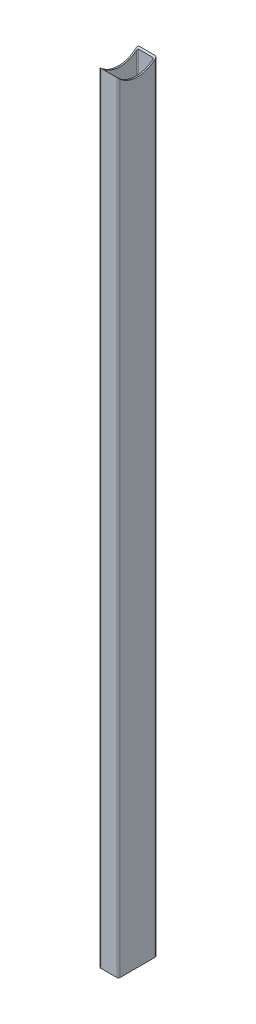
ISO-10303-21;
HEADER;
FILE_DESCRIPTION(('STEP AP214'),'2;1');
FILE_NAME('part.step','',(''),(''),'','','');
FILE_SCHEMA(('AUTOMOTIVE_DESIGN { 1 0 10303 214 1 1 1 1 }'));
ENDSEC;
DATA;
#1=APPLICATION_CONTEXT('core data for automotive mechanical design processes');
#2=APPLICATION_PROTOCOL_DEFINITION('international standard','automotive_design',2000,#1);
#3=PRODUCT_CONTEXT('',#1,'mechanical');
#4=PRODUCT('Part','Part','',(#3));
#5=PRODUCT_RELATED_PRODUCT_CATEGORY('part','',(#4));
#6=PRODUCT_DEFINITION_FORMATION('','',#4);
#7=PRODUCT_DEFINITION_CONTEXT('part definition',#1,'design');
#8=PRODUCT_DEFINITION('design','',#6,#7);
#9=PRODUCT_DEFINITION_SHAPE('','',#8);
#10=(LENGTH_UNIT() NAMED_UNIT(*) SI_UNIT(.MILLI.,.METRE.));
#11=(NAMED_UNIT(*) PLANE_ANGLE_UNIT() SI_UNIT($,.RADIAN.));
#12=(NAMED_UNIT(*) SI_UNIT($,.STERADIAN.) SOLID_ANGLE_UNIT());
#13=UNCERTAINTY_MEASURE_WITH_UNIT(LENGTH_MEASURE(1.E-05),#10,'distance_accuracy_value','');
#14=(GEOMETRIC_REPRESENTATION_CONTEXT(3) GLOBAL_UNCERTAINTY_ASSIGNED_CONTEXT((#13)) GLOBAL_UNIT_ASSIGNED_CONTEXT((#10,
#11,#12)) REPRESENTATION_CONTEXT('',''));
#15=CARTESIAN_POINT('',(0.,0.,0.));
#16=DIRECTION('',(0.,0.,1.));
#17=DIRECTION('',(1.,0.,0.));
#18=AXIS2_PLACEMENT_3D('',#15,#16,#17);
#19=CARTESIAN_POINT('',(1.499999999951,862.501,18.5));
#20=DIRECTION('',(0.,-1.,0.));
#21=DIRECTION('',(0.,0.,-1.));
#22=AXIS2_PLACEMENT_3D('',#19,#20,#21);
#23=CYLINDRICAL_SURFACE('',#22,1.5);
#24=CARTESIAN_POINT('',(-4.90081066006898E-11,814.653010050624,18.5));
#25=CARTESIAN_POINT('',(7.30435504471994E-06,814.695462627753,18.546691985452));
#26=CARTESIAN_POINT('',(0.00218000827948997,814.738060798896,18.5932187807497));
#27=CARTESIAN_POINT('',(0.0108205652073681,814.823380410035,18.6857694418457));
#28=CARTESIAN_POINT('',(0.0172889873663088,814.866101865619,18.7317932401786));
#29=CARTESIAN_POINT('',(0.0431845103338715,814.994683944242,18.8693695086153));
#30=CARTESIAN_POINT('',(0.0691012309733102,815.080459256448,18.9598738396438));
#31=CARTESIAN_POINT('',(0.13884570583917,815.25113121617,19.1375970737993));
#32=CARTESIAN_POINT('',(0.182950957465307,815.335992363237,19.2247411235328));
#33=CARTESIAN_POINT('',(0.289864777848783,815.500765465674,19.3918416231965));
#34=CARTESIAN_POINT('',(0.352629834144788,815.580688418312,19.4718142374703));
#35=CARTESIAN_POINT('',(0.475885185609801,815.708570285806,19.5983728963342));
#36=CARTESIAN_POINT('',(0.531192829918792,815.75882575246,19.6476862012693));
#37=CARTESIAN_POINT('',(0.65192017080001,815.853087395314,19.7395552345383));
#38=CARTESIAN_POINT('',(0.717327538064841,815.8971010672,19.7821190755995));
#39=CARTESIAN_POINT('',(0.842406169397348,815.967261578513,19.8496018639839));
#40=CARTESIAN_POINT('',(0.900080290298504,815.995202146607,19.8763375751384));
#41=CARTESIAN_POINT('',(1.02085119046355,816.043997130117,19.9228786035671));
#42=CARTESIAN_POINT('',(1.08393227330552,816.064871241041,19.9427031880942));
#43=CARTESIAN_POINT('',(1.20521673179596,816.095648697567,19.9718775632913));
#44=CARTESIAN_POINT('',(1.26286636010349,816.106678912796,19.9823053545535));
#45=CARTESIAN_POINT('',(1.35081783343951,816.117849919002,19.9928595387236));
#46=CARTESIAN_POINT('',(1.3805037816435,816.12067825902,19.9955300250173));
#47=CARTESIAN_POINT('',(1.44012152436002,816.124462993875,19.9991026272695));
#48=CARTESIAN_POINT('',(1.47005348029876,816.125418041235,20.0000034703092));
#49=CARTESIAN_POINT('',(1.49999999995103,816.125413911822,20.));
#50=B_SPLINE_CURVE_WITH_KNOTS('',3,(#24,#25,#26,#27,#28,#29,#30,#31,#32,#33,#34,#35,#36,#37,#38,
#39,#40,#41,#42,#43,#44,#45,#46,#47,#48,#49),.UNSPECIFIED.,.F.,.F.,(4,2,2,2,2,2,2,2,2,2,2,2,4),
(0.,0.189233362172743,0.37849180157302,0.75923270951333,1.14601099830748,1.53189434719916,
1.79967967808632,2.06714065553922,2.27468866915641,2.48165335182276,2.65963914067694,
2.74935789937733,2.83914116992311),.UNSPECIFIED.);
#51=CARTESIAN_POINT('',(-4.9069255603218E-11,814.653010050624,18.5));
#52=VERTEX_POINT('',#51);
#53=CARTESIAN_POINT('',(1.49999999995102,816.125413911823,20.));
#54=VERTEX_POINT('',#53);
#55=EDGE_CURVE('E171',#52,#54,#50,.T.);
#56=ORIENTED_EDGE('',*,*,#55,.F.);
#57=DIRECTION('',(0.,-1.,0.));
#58=VECTOR('',#57,1.);
#59=CARTESIAN_POINT('',(-4.90033361111308E-11,862.501,18.5));
#60=LINE('',#59,#58);
#61=CARTESIAN_POINT('',(-4.90033361111308E-11,0.,18.5));
#62=VERTEX_POINT('',#61);
#63=EDGE_CURVE('E157',#52,#62,#60,.T.);
#64=ORIENTED_EDGE('',*,*,#63,.T.);
#65=CARTESIAN_POINT('',(1.499999999951,0.,18.5));
#66=DIRECTION('',(0.,1.,0.));
#67=DIRECTION('',(0.,0.,-1.));
#68=AXIS2_PLACEMENT_3D('',#65,#66,#67);
#69=CIRCLE('',#68,1.5);
#70=CARTESIAN_POINT('',(1.49999999995102,0.,20.));
#71=VERTEX_POINT('',#70);
#72=EDGE_CURVE('E167',#62,#71,#69,.T.);
#73=ORIENTED_EDGE('',*,*,#72,.T.);
#74=DIRECTION('',(0.,-1.,0.));
#75=VECTOR('',#74,1.);
#76=CARTESIAN_POINT('',(1.49999999995102,862.501,20.));
#77=LINE('',#76,#75);
#78=EDGE_CURVE('E172',#54,#71,#77,.T.);
#79=ORIENTED_EDGE('',*,*,#78,.F.);
#80=EDGE_LOOP('',(#56,#64,#73,#79));
#81=FACE_BOUND('',#80,.T.);
#82=ADVANCED_FACE('F34',(#81),#23,.T.);
#83=CARTESIAN_POINT('',(18.499999999951,862.501,20.));
#84=DIRECTION('',(0.,0.,-1.));
#85=DIRECTION('',(-1.,0.,0.));
#86=AXIS2_PLACEMENT_3D('',#83,#84,#85);
#87=PLANE('',#86);
#88=DIRECTION('',(1.,0.,0.));
#89=VECTOR('',#88,1.);
#90=CARTESIAN_POINT('',(1000.,816.125413911823,20.));
#91=LINE('',#90,#89);
#92=CARTESIAN_POINT('',(18.499999999951,816.125413911822,20.));
#93=VERTEX_POINT('',#92);
#94=EDGE_CURVE('E175',#54,#93,#91,.T.);
#95=ORIENTED_EDGE('',*,*,#94,.F.);
#96=ORIENTED_EDGE('',*,*,#78,.T.);
#97=DIRECTION('',(1.,0.,0.));
#98=VECTOR('',#97,1.);
#99=CARTESIAN_POINT('',(18.499999999951,0.,20.));
#100=LINE('',#99,#98);
#101=CARTESIAN_POINT('',(18.499999999951,0.,20.));
#102=VERTEX_POINT('',#101);
#103=EDGE_CURVE('E211',#71,#102,#100,.T.);
#104=ORIENTED_EDGE('',*,*,#103,.T.);
#105=DIRECTION('',(0.,-1.,0.));
#106=VECTOR('',#105,1.);
#107=CARTESIAN_POINT('',(18.499999999951,862.501,20.));
#108=LINE('',#107,#106);
#109=EDGE_CURVE('E212',#93,#102,#108,.T.);
#110=ORIENTED_EDGE('',*,*,#109,.F.);
#111=EDGE_LOOP('',(#95,#96,#104,#110));
#112=FACE_BOUND('',#111,.T.);
#113=ADVANCED_FACE('F304',(#112),#87,.F.);
#114=CARTESIAN_POINT('',(18.499999999951,862.501,18.5));
#115=DIRECTION('',(0.,-1.,0.));
#116=DIRECTION('',(0.,0.,-1.));
#117=AXIS2_PLACEMENT_3D('',#114,#115,#116);
#118=CYLINDRICAL_SURFACE('',#117,1.50000000000001);
#119=CARTESIAN_POINT('',(18.499999999951,816.125413911822,20.));
#120=CARTESIAN_POINT('',(18.5333113732731,816.125424087684,20.0000088116086));
#121=CARTESIAN_POINT('',(18.5666152079335,816.124238455771,19.9988906724533));
#122=CARTESIAN_POINT('',(18.6328835528713,816.11955401349,19.9944686876159));
#123=CARTESIAN_POINT('',(18.6658483497157,816.116057353734,19.9911668740292));
#124=CARTESIAN_POINT('',(18.7308684166158,816.106872669418,19.9824867495289));
#125=CARTESIAN_POINT('',(18.7629293402837,816.101205684626,19.9771283744821));
#126=CARTESIAN_POINT('',(18.8262192850358,816.087816574404,19.964453495491));
#127=CARTESIAN_POINT('',(18.8574481580004,816.080094085713,19.9571366454313));
#128=CARTESIAN_POINT('',(18.9493527110668,816.054139888762,19.9325099338898));
#129=CARTESIAN_POINT('',(19.0085368907333,816.033078245195,19.9124832938736));
#130=CARTESIAN_POINT('',(19.1218904187204,815.98480390376,19.8663895352073));
#131=CARTESIAN_POINT('',(19.1760463656176,815.957575397783,19.8403068882126));
#132=CARTESIAN_POINT('',(19.3022249274388,815.884885235681,19.7703295412264));
#133=CARTESIAN_POINT('',(19.3712088466082,815.836755424213,19.7237219263429));
#134=CARTESIAN_POINT('',(19.4976494455237,815.733685237651,19.6230564583275));
#135=CARTESIAN_POINT('',(19.5550825233357,815.678731281754,19.5689837241006));
#136=CARTESIAN_POINT('',(19.6788997970576,815.542379807497,19.4335635500316));
#137=CARTESIAN_POINT('',(19.7402693280586,815.458923656369,19.3497091047197));
#138=CARTESIAN_POINT('',(19.8434028116411,815.287422961515,19.1749673553413));
#139=CARTESIAN_POINT('',(19.8851388896993,815.199372090163,19.0840702643239));
#140=CARTESIAN_POINT('',(19.9449324985606,815.034480748939,18.9113754961407));
#141=CARTESIAN_POINT('',(19.9655743855466,814.957902130196,18.8302129095988));
#142=CARTESIAN_POINT('',(19.9862129565659,814.843177099591,18.7071009885416));
#143=CARTESIAN_POINT('',(19.9913716528525,814.805053823465,18.6659396699617));
#144=CARTESIAN_POINT('',(19.998262989844,814.728917439247,18.5832283507239));
#145=CARTESIAN_POINT('',(19.9999955374597,814.690904334177,18.5416783395359));
#146=CARTESIAN_POINT('',(19.999999999951,814.653010050624,18.5));
#147=B_SPLINE_CURVE_WITH_KNOTS('',3,(#119,#120,#121,#122,#123,#124,#125,#126,#127,#128,#129,
#130,#131,#132,#133,#134,#135,#136,#137,#138,#139,#140,#141,#142,#143,#144,#145,#146),
.UNSPECIFIED.,.F.,.F.,(4,2,2,2,2,2,2,2,2,2,2,2,2,4),(0.,0.0998820554474782,0.19967129266649,
0.298516676841998,0.39737954121553,0.594227700382906,0.791586288007646,1.07846843536314,
1.36593094554802,1.76364029717461,2.16191260366413,2.50144706730808,2.67037656865549,
2.83931065979073),.UNSPECIFIED.);
#148=CARTESIAN_POINT('',(19.9999999999511,814.653010050624,18.5));
#149=VERTEX_POINT('',#148);
#150=EDGE_CURVE('E293',#93,#149,#147,.T.);
#151=ORIENTED_EDGE('',*,*,#150,.F.);
#152=ORIENTED_EDGE('',*,*,#109,.T.);
#153=CARTESIAN_POINT('',(18.499999999951,0.,18.5));
#154=DIRECTION('',(0.,1.,0.));
#155=DIRECTION('',(0.,0.,-1.));
#156=AXIS2_PLACEMENT_3D('',#153,#154,#155);
#157=CIRCLE('',#156,1.50000000000001);
#158=CARTESIAN_POINT('',(19.999999999951,0.,18.5));
#159=VERTEX_POINT('',#158);
#160=EDGE_CURVE('E214',#102,#159,#157,.T.);
#161=ORIENTED_EDGE('',*,*,#160,.T.);
#162=DIRECTION('',(0.,-1.,0.));
#163=VECTOR('',#162,1.);
#164=CARTESIAN_POINT('',(19.999999999951,862.501,18.5));
#165=LINE('',#164,#163);
#166=EDGE_CURVE('E215',#149,#159,#165,.T.);
#167=ORIENTED_EDGE('',*,*,#166,.F.);
#168=EDGE_LOOP('',(#151,#152,#161,#167));
#169=FACE_BOUND('',#168,.T.);
#170=ADVANCED_FACE('F300',(#169),#118,.T.);
#171=CARTESIAN_POINT('',(19.999999999951,862.501,18.5));
#172=DIRECTION('',(-1.,0.,0.));
#173=DIRECTION('',(0.,0.,1.));
#174=AXIS2_PLACEMENT_3D('',#171,#172,#173);
#175=PLANE('',#174);
#176=CARTESIAN_POINT('',(19.9999999999511,835.,6.65578703262783E-13));
#177=DIRECTION('',(-1.,0.,0.));
#178=DIRECTION('',(0.,0.,1.));
#179=AXIS2_PLACEMENT_3D('',#176,#177,#178);
#180=CIRCLE('',#179,27.5);
#181=CARTESIAN_POINT('',(19.999999999951,814.653010050625,-18.5));
#182=VERTEX_POINT('',#181);
#183=EDGE_CURVE('E185',#149,#182,#180,.F.);
#184=ORIENTED_EDGE('',*,*,#183,.F.);
#185=ORIENTED_EDGE('',*,*,#166,.T.);
#186=DIRECTION('',(0.,0.,-1.));
#187=VECTOR('',#186,1.);
#188=CARTESIAN_POINT('',(19.999999999951,0.,18.5));
#189=LINE('',#188,#187);
#190=CARTESIAN_POINT('',(19.999999999951,0.,-18.5));
#191=VERTEX_POINT('',#190);
#192=EDGE_CURVE('E217',#159,#191,#189,.T.);
#193=ORIENTED_EDGE('',*,*,#192,.T.);
#194=DIRECTION('',(0.,-1.,0.));
#195=VECTOR('',#194,1.);
#196=CARTESIAN_POINT('',(19.999999999951,862.501,-18.5));
#197=LINE('',#196,#195);
#198=EDGE_CURVE('E218',#182,#191,#197,.T.);
#199=ORIENTED_EDGE('',*,*,#198,.F.);
#200=EDGE_LOOP('',(#184,#185,#193,#199));
#201=FACE_BOUND('',#200,.T.);
#202=ADVANCED_FACE('F283',(#201),#175,.F.);
#203=CARTESIAN_POINT('',(18.499999999951,862.501,-18.5));
#204=DIRECTION('',(0.,-1.,0.));
#205=DIRECTION('',(0.,0.,-1.));
#206=AXIS2_PLACEMENT_3D('',#203,#204,#205);
#207=CYLINDRICAL_SURFACE('',#206,1.5);
#208=CARTESIAN_POINT('',(19.999999999951,814.653010050625,-18.5));
#209=CARTESIAN_POINT('',(19.9999926955469,814.695462627754,-18.5466919854521));
#210=CARTESIAN_POINT('',(19.9978199916225,814.738060798897,-18.5932187807498));
#211=CARTESIAN_POINT('',(19.9891794346946,814.823380410037,-18.6857694418457));
#212=CARTESIAN_POINT('',(19.9827110125357,814.86610186562,-18.7317932401786));
#213=CARTESIAN_POINT('',(19.9568154895681,814.994683944243,-18.8693695086154));
#214=CARTESIAN_POINT('',(19.9308987689287,815.080459256449,-18.9598738396438));
#215=CARTESIAN_POINT('',(19.8611542940628,815.251131216171,-19.1375970737994));
#216=CARTESIAN_POINT('',(19.8170490424367,815.335992363238,-19.2247411235328));
#217=CARTESIAN_POINT('',(19.7101352220532,815.500765465676,-19.3918416231966));
#218=CARTESIAN_POINT('',(19.6473701657572,815.580688418313,-19.4718142374704));
#219=CARTESIAN_POINT('',(19.5241148142921,815.708570285808,-19.5983728963342));
#220=CARTESIAN_POINT('',(19.4688071699831,815.758825752462,-19.6476862012694));
#221=CARTESIAN_POINT('',(19.3480798291019,815.853087395315,-19.7395552345383));
#222=CARTESIAN_POINT('',(19.2826724618371,815.897101067202,-19.7821190755995));
#223=CARTESIAN_POINT('',(19.1575938305047,815.967261578514,-19.8496018639839));
#224=CARTESIAN_POINT('',(19.0999197096035,815.995202146608,-19.8763375751384));
#225=CARTESIAN_POINT('',(18.9791488094385,816.043997130118,-19.9228786035671));
#226=CARTESIAN_POINT('',(18.9160677265965,816.064871241043,-19.9427031880942));
#227=CARTESIAN_POINT('',(18.7947832681061,816.095648697568,-19.9718775632913));
#228=CARTESIAN_POINT('',(18.7371336397985,816.106678912797,-19.9823053545535));
#229=CARTESIAN_POINT('',(18.6491821664625,816.117849919003,-19.9928595387236));
#230=CARTESIAN_POINT('',(18.6194962182585,816.120678259022,-19.9955300250173));
#231=CARTESIAN_POINT('',(18.559878475542,816.124462993876,-19.9991026272695));
#232=CARTESIAN_POINT('',(18.5299465196033,816.125418041236,-20.0000034703092));
#233=CARTESIAN_POINT('',(18.499999999951,816.125413911824,-20.));
#234=B_SPLINE_CURVE_WITH_KNOTS('',3,(#208,#209,#210,#211,#212,#213,#214,#215,#216,#217,#218,
#219,#220,#221,#222,#223,#224,#225,#226,#227,#228,#229,#230,#231,#232,#233),.UNSPECIFIED.,.F.,
.F.,(4,2,2,2,2,2,2,2,2,2,2,2,4),(0.,0.18923336217275,0.378491801573142,0.759232709513421,
1.14601099830756,1.53189434719939,1.79967967808651,2.06714065553934,2.27468866915651,
2.48165335182286,2.65963914067704,2.74935789937744,2.83914116992321),.UNSPECIFIED.);
#235=CARTESIAN_POINT('',(18.499999999951,816.125413911824,-20.));
#236=VERTEX_POINT('',#235);
#237=EDGE_CURVE('E286',#182,#236,#234,.T.);
#238=ORIENTED_EDGE('',*,*,#237,.F.);
#239=ORIENTED_EDGE('',*,*,#198,.T.);
#240=CARTESIAN_POINT('',(18.499999999951,0.,-18.5));
#241=DIRECTION('',(0.,1.,0.));
#242=DIRECTION('',(0.,0.,1.));
#243=AXIS2_PLACEMENT_3D('',#240,#241,#242);
#244=CIRCLE('',#243,1.5);
#245=CARTESIAN_POINT('',(18.499999999951,0.,-20.));
#246=VERTEX_POINT('',#245);
#247=EDGE_CURVE('E220',#191,#246,#244,.T.);
#248=ORIENTED_EDGE('',*,*,#247,.T.);
#249=DIRECTION('',(0.,-1.,0.));
#250=VECTOR('',#249,1.);
#251=CARTESIAN_POINT('',(18.499999999951,862.501,-20.));
#252=LINE('',#251,#250);
#253=EDGE_CURVE('E221',#236,#246,#252,.T.);
#254=ORIENTED_EDGE('',*,*,#253,.F.);
#255=EDGE_LOOP('',(#238,#239,#248,#254));
#256=FACE_BOUND('',#255,.T.);
#257=ADVANCED_FACE('F279',(#256),#207,.T.);
#258=CARTESIAN_POINT('',(18.499999999951,862.501,-20.));
#259=DIRECTION('',(0.,0.,1.));
#260=DIRECTION('',(1.,0.,0.));
#261=AXIS2_PLACEMENT_3D('',#258,#259,#260);
#262=PLANE('',#261);
#263=DIRECTION('',(1.,0.,0.));
#264=VECTOR('',#263,1.);
#265=CARTESIAN_POINT('',(1000.,816.125413911824,-20.));
#266=LINE('',#265,#264);
#267=CARTESIAN_POINT('',(1.49999999995102,816.125413911824,-20.));
#268=VERTEX_POINT('',#267);
#269=EDGE_CURVE('E45',#236,#268,#266,.F.);
#270=ORIENTED_EDGE('',*,*,#269,.F.);
#271=ORIENTED_EDGE('',*,*,#253,.T.);
#272=DIRECTION('',(-1.,0.,0.));
#273=VECTOR('',#272,1.);
#274=CARTESIAN_POINT('',(18.499999999951,0.,-20.));
#275=LINE('',#274,#273);
#276=CARTESIAN_POINT('',(1.49999999995102,0.,-20.));
#277=VERTEX_POINT('',#276);
#278=EDGE_CURVE('E222',#246,#277,#275,.T.);
#279=ORIENTED_EDGE('',*,*,#278,.T.);
#280=DIRECTION('',(0.,-1.,0.));
#281=VECTOR('',#280,1.);
#282=CARTESIAN_POINT('',(1.49999999995102,862.501,-20.));
#283=LINE('',#282,#281);
#284=EDGE_CURVE('E223',#268,#277,#283,.T.);
#285=ORIENTED_EDGE('',*,*,#284,.F.);
#286=EDGE_LOOP('',(#270,#271,#279,#285));
#287=FACE_BOUND('',#286,.T.);
#288=ADVANCED_FACE('F275',(#287),#262,.F.);
#289=CARTESIAN_POINT('',(1.49999999995099,862.501,-18.5));
#290=DIRECTION('',(0.,-1.,0.));
#291=DIRECTION('',(0.,0.,-1.));
#292=AXIS2_PLACEMENT_3D('',#289,#290,#291);
#293=CYLINDRICAL_SURFACE('',#292,1.5);
#294=CARTESIAN_POINT('',(1.49999999995102,816.125413911824,-20.));
#295=CARTESIAN_POINT('',(1.46668862662889,816.125424087685,-20.0000088116086));
#296=CARTESIAN_POINT('',(1.43338479196853,816.124238455772,-19.9988906724533));
#297=CARTESIAN_POINT('',(1.36711644703071,816.119554013492,-19.994468687616));
#298=CARTESIAN_POINT('',(1.33415165018626,816.116057353736,-19.9911668740292));
#299=CARTESIAN_POINT('',(1.26913158328619,816.106872669419,-19.9824867495289));
#300=CARTESIAN_POINT('',(1.23707065961828,816.101205684627,-19.9771283744821));
#301=CARTESIAN_POINT('',(1.17378071486622,816.087816574406,-19.964453495491));
#302=CARTESIAN_POINT('',(1.14255184190159,816.080094085714,-19.9571366454313));
#303=CARTESIAN_POINT('',(1.05064728883521,816.054139888763,-19.9325099338898));
#304=CARTESIAN_POINT('',(0.991463109168682,816.033078245196,-19.9124832938736));
#305=CARTESIAN_POINT('',(0.87810958118168,815.984803903761,-19.8663895352073));
#306=CARTESIAN_POINT('',(0.82395363428446,815.957575397785,-19.8403068882126));
#307=CARTESIAN_POINT('',(0.697775072463238,815.884885235682,-19.7703295412264));
#308=CARTESIAN_POINT('',(0.628791153293828,815.836755424214,-19.7237219263429));
#309=CARTESIAN_POINT('',(0.502350554378285,815.733685237652,-19.6230564583276));
#310=CARTESIAN_POINT('',(0.444917476566286,815.678731281755,-19.5689837241006));
#311=CARTESIAN_POINT('',(0.321100202844451,815.542379807498,-19.4335635500317));
#312=CARTESIAN_POINT('',(0.259730671843445,815.458923656371,-19.3497091047198));
#313=CARTESIAN_POINT('',(0.156597188260996,815.287422961516,-19.1749673553414));
#314=CARTESIAN_POINT('',(0.114861110202781,815.199372090165,-19.0840702643241));
#315=CARTESIAN_POINT('',(0.0550675013413811,815.034480748941,-18.9113754961408));
#316=CARTESIAN_POINT('',(0.034425614355364,814.957902130198,-18.8302129095988));
#317=CARTESIAN_POINT('',(0.0137870433360509,814.843177099593,-18.7071009885416));
#318=CARTESIAN_POINT('',(0.00862834704948749,814.805053823466,-18.6659396699618));
#319=CARTESIAN_POINT('',(0.00173701005803714,814.728917439248,-18.583228350724));
#320=CARTESIAN_POINT('',(4.46244234632895E-06,814.690904334179,-18.541678339536));
#321=CARTESIAN_POINT('',(-4.90084382694184E-11,814.653010050625,-18.5));
#322=B_SPLINE_CURVE_WITH_KNOTS('',3,(#294,#295,#296,#297,#298,#299,#300,#301,#302,#303,#304,
#305,#306,#307,#308,#309,#310,#311,#312,#313,#314,#315,#316,#317,#318,#319,#320,#321),
.UNSPECIFIED.,.F.,.F.,(4,2,2,2,2,2,2,2,2,2,2,2,2,4),(0.,0.0998820554474835,0.199671292666493,
0.298516676842009,0.397379541215487,0.594227700382861,0.791586288007568,1.0784684353631,
1.36593094554795,1.76364029717448,2.16191260366398,2.50144706730812,2.67037656865558,
2.83931065979085),.UNSPECIFIED.);
#323=CARTESIAN_POINT('',(-4.90744597736459E-11,814.653010050625,-18.5));
#324=VERTEX_POINT('',#323);
#325=EDGE_CURVE('E11',#268,#324,#322,.T.);
#326=ORIENTED_EDGE('',*,*,#325,.F.);
#327=ORIENTED_EDGE('',*,*,#284,.T.);
#328=CARTESIAN_POINT('',(1.49999999995099,0.,-18.5));
#329=DIRECTION('',(0.,1.,0.));
#330=DIRECTION('',(0.,0.,-1.));
#331=AXIS2_PLACEMENT_3D('',#328,#329,#330);
#332=CIRCLE('',#331,1.5);
#333=CARTESIAN_POINT('',(-4.90085402815588E-11,0.,-18.5));
#334=VERTEX_POINT('',#333);
#335=EDGE_CURVE('E224',#277,#334,#332,.T.);
#336=ORIENTED_EDGE('',*,*,#335,.T.);
#337=DIRECTION('',(0.,-1.,0.));
#338=VECTOR('',#337,1.);
#339=CARTESIAN_POINT('',(-4.90085402815588E-11,862.501,-18.5));
#340=LINE('',#339,#338);
#341=EDGE_CURVE('E39',#324,#334,#340,.T.);
#342=ORIENTED_EDGE('',*,*,#341,.F.);
#343=EDGE_LOOP('',(#326,#327,#336,#342));
#344=FACE_BOUND('',#343,.T.);
#345=ADVANCED_FACE('F270',(#344),#293,.T.);
#346=CARTESIAN_POINT('',(-4.90033361111308E-11,862.501,18.5));
#347=DIRECTION('',(1.,0.,0.));
#348=DIRECTION('',(0.,0.,-1.));
#349=AXIS2_PLACEMENT_3D('',#346,#347,#348);
#350=PLANE('',#349);
#351=CARTESIAN_POINT('',(-4.90718576884319E-11,835.,6.66133814775095E-13));
#352=DIRECTION('',(1.,0.,0.));
#353=DIRECTION('',(0.,0.,-1.));
#354=AXIS2_PLACEMENT_3D('',#351,#352,#353);
#355=CIRCLE('',#354,27.5);
#356=EDGE_CURVE('E161',#324,#52,#355,.F.);
#357=ORIENTED_EDGE('',*,*,#356,.F.);
#358=ORIENTED_EDGE('',*,*,#341,.T.);
#359=DIRECTION('',(0.,0.,1.));
#360=VECTOR('',#359,1.);
#361=CARTESIAN_POINT('',(-4.90033361111308E-11,0.,18.5));
#362=LINE('',#361,#360);
#363=EDGE_CURVE('E163',#334,#62,#362,.T.);
#364=ORIENTED_EDGE('',*,*,#363,.T.);
#365=ORIENTED_EDGE('',*,*,#63,.F.);
#366=EDGE_LOOP('',(#357,#358,#364,#365));
#367=FACE_BOUND('',#366,.T.);
#368=ADVANCED_FACE('F159',(#367),#350,.F.);
#369=CARTESIAN_POINT('',(2.49999999995099,862.501,-17.5));
#370=DIRECTION('',(0.,-1.,0.));
#371=DIRECTION('',(0.,0.,-1.));
#372=AXIS2_PLACEMENT_3D('',#369,#370,#371);
#373=CYLINDRICAL_SURFACE('',#372,0.999999999999994);
#374=DIRECTION('',(0.,-1.,0.));
#375=VECTOR('',#374,1.);
#376=CARTESIAN_POINT('',(2.49999999995099,862.501,-18.5));
#377=LINE('',#376,#375);
#378=CARTESIAN_POINT('',(2.49999999995099,814.653010050626,-18.5));
#379=VERTEX_POINT('',#378);
#380=CARTESIAN_POINT('',(2.49999999995099,0.,-18.5));
#381=VERTEX_POINT('',#380);
#382=EDGE_CURVE('E207',#379,#381,#377,.T.);
#383=ORIENTED_EDGE('',*,*,#382,.F.);
#384=CARTESIAN_POINT('',(2.49999999995099,814.653010050625,-18.5));
#385=CARTESIAN_POINT('',(2.4768758007585,814.653012903492,-18.5000028203874));
#386=CARTESIAN_POINT('',(2.45376543957132,814.652280128873,-18.4991972318456));
#387=CARTESIAN_POINT('',(2.40776137938364,814.649376694845,-18.4960033043079));
#388=CARTESIAN_POINT('',(2.38486753816628,814.64720705699,-18.4936160897866));
#389=CARTESIAN_POINT('',(2.31714059027825,814.638641336101,-18.4841864363175));
#390=CARTESIAN_POINT('',(2.27285302025477,814.630187137745,-18.4748746344818));
#391=CARTESIAN_POINT('',(2.18720801666056,814.608435415342,-18.4508631192869));
#392=CARTESIAN_POINT('',(2.14584362310439,814.595149892811,-18.436176756335));
#393=CARTESIAN_POINT('',(2.0665779903082,814.564524809467,-18.4022248060017));
#394=CARTESIAN_POINT('',(2.02868421706482,814.54717678172,-18.3829496534079));
#395=CARTESIAN_POINT('',(1.94342135576491,814.502164490542,-18.3327643627301));
#396=CARTESIAN_POINT('',(1.89778678201146,814.473065422087,-18.3001956239715));
#397=CARTESIAN_POINT('',(1.81417470855712,814.41054194512,-18.2298229485488));
#398=CARTESIAN_POINT('',(1.77621056636586,814.377110154813,-18.1920100693846));
#399=CARTESIAN_POINT('',(1.69739912389999,814.296633873829,-18.100424631936));
#400=CARTESIAN_POINT('',(1.65919535809688,814.248544590507,-18.0452988640444));
#401=CARTESIAN_POINT('',(1.59511161754661,814.149434234561,-17.9306908265584));
#402=CARTESIAN_POINT('',(1.56924711037069,814.098409571628,-17.8712031964045));
#403=CARTESIAN_POINT('',(1.53289199741373,814.003768269603,-17.7598603001842));
#404=CARTESIAN_POINT('',(1.52053844484862,813.960362167747,-17.7084207546165));
#405=CARTESIAN_POINT('',(1.50412568657601,813.873501265473,-17.6047060742996));
#406=CARTESIAN_POINT('',(1.50002615078288,813.830047744954,-17.5524362664432));
#407=CARTESIAN_POINT('',(1.499999999951,813.786796564404,-17.5000000000001));
#408=B_SPLINE_CURVE_WITH_KNOTS('',3,(#384,#385,#386,#387,#388,#389,#390,#391,#392,#393,#394,
#395,#396,#397,#398,#399,#400,#401,#402,#403,#404,#405,#406,#407),.UNSPECIFIED.,.F.,.F.,(4,2,2,
2,2,2,2,2,2,2,2,4),(0.,0.0693207055212529,0.138592179527208,0.275926774670232,0.412922520954456,
0.550206370971967,0.738672865075858,0.927464783810286,1.17375700665125,1.4203571570221,
1.62515244956237,1.82894463618197),.UNSPECIFIED.);
#409=CARTESIAN_POINT('',(1.49999999995098,813.786796564404,-17.5));
#410=VERTEX_POINT('',#409);
#411=EDGE_CURVE('E81',#379,#410,#408,.T.);
#412=ORIENTED_EDGE('',*,*,#411,.T.);
#413=DIRECTION('',(0.,-1.,0.));
#414=VECTOR('',#413,1.);
#415=CARTESIAN_POINT('',(1.49999999995099,862.501,-17.5));
#416=LINE('',#415,#414);
#417=CARTESIAN_POINT('',(1.49999999995099,0.,-17.5));
#418=VERTEX_POINT('',#417);
#419=EDGE_CURVE('E151',#410,#418,#416,.T.);
#420=ORIENTED_EDGE('',*,*,#419,.T.);
#421=CARTESIAN_POINT('',(2.49999999995099,0.,-17.5));
#422=DIRECTION('',(0.,1.,0.));
#423=DIRECTION('',(0.,0.,-1.));
#424=AXIS2_PLACEMENT_3D('',#421,#422,#423);
#425=CIRCLE('',#424,0.999999999999994);
#426=EDGE_CURVE('E246',#381,#418,#425,.T.);
#427=ORIENTED_EDGE('',*,*,#426,.F.);
#428=EDGE_LOOP('',(#383,#412,#420,#427));
#429=FACE_BOUND('',#428,.T.);
#430=ADVANCED_FACE('F331',(#429),#373,.F.);
#431=CARTESIAN_POINT('',(1.499999999951,862.501,17.5));
#432=DIRECTION('',(1.,0.,0.));
#433=DIRECTION('',(0.,0.,-1.));
#434=AXIS2_PLACEMENT_3D('',#431,#432,#433);
#435=PLANE('',#434);
#436=ORIENTED_EDGE('',*,*,#419,.F.);
#437=CARTESIAN_POINT('',(1.49999999995098,835.,6.66092181411672E-13));
#438=DIRECTION('',(1.,0.,0.));
#439=DIRECTION('',(0.,0.,-1.));
#440=AXIS2_PLACEMENT_3D('',#437,#438,#439);
#441=CIRCLE('',#440,27.5);
#442=CARTESIAN_POINT('',(1.49999999995099,813.786796564403,17.5));
#443=VERTEX_POINT('',#442);
#444=EDGE_CURVE('E54',#410,#443,#441,.F.);
#445=ORIENTED_EDGE('',*,*,#444,.T.);
#446=DIRECTION('',(0.,-1.,0.));
#447=VECTOR('',#446,1.);
#448=CARTESIAN_POINT('',(1.499999999951,862.501,17.5));
#449=LINE('',#448,#447);
#450=CARTESIAN_POINT('',(1.499999999951,0.,17.5));
#451=VERTEX_POINT('',#450);
#452=EDGE_CURVE('E189',#443,#451,#449,.T.);
#453=ORIENTED_EDGE('',*,*,#452,.T.);
#454=DIRECTION('',(0.,0.,1.));
#455=VECTOR('',#454,1.);
#456=CARTESIAN_POINT('',(1.499999999951,0.,17.5));
#457=LINE('',#456,#455);
#458=EDGE_CURVE('E259',#418,#451,#457,.T.);
#459=ORIENTED_EDGE('',*,*,#458,.F.);
#460=EDGE_LOOP('',(#436,#445,#453,#459));
#461=FACE_BOUND('',#460,.T.);
#462=ADVANCED_FACE('F335',(#461),#435,.T.);
#463=CARTESIAN_POINT('',(2.499999999951,862.501,17.5));
#464=DIRECTION('',(0.,-1.,0.));
#465=DIRECTION('',(0.,0.,-1.));
#466=AXIS2_PLACEMENT_3D('',#463,#464,#465);
#467=CYLINDRICAL_SURFACE('',#466,1.);
#468=ORIENTED_EDGE('',*,*,#452,.F.);
#469=CARTESIAN_POINT('',(1.49999999995099,813.786796564403,17.5));
#470=CARTESIAN_POINT('',(1.50000558626687,813.81364068013,17.5325405327336));
#471=CARTESIAN_POINT('',(1.50158851158288,813.840547910511,17.5650037430444));
#472=CARTESIAN_POINT('',(1.50790518564271,813.894368064593,17.629636081336));
#473=CARTESIAN_POINT('',(1.51264000800685,813.921280987108,17.6618051053227));
#474=CARTESIAN_POINT('',(1.53163316329864,814.00211023233,17.7579738939739));
#475=CARTESIAN_POINT('',(1.55068021298058,814.055823687688,17.8212799099531));
#476=CARTESIAN_POINT('',(1.59971183862412,814.157123823627,17.9396244361263));
#477=CARTESIAN_POINT('',(1.62874983699179,814.204865100494,17.994925092032));
#478=CARTESIAN_POINT('',(1.69817323461053,814.297038117172,18.1008913355465));
#479=CARTESIAN_POINT('',(1.73853188491149,814.341477349838,18.1515674805229));
#480=CARTESIAN_POINT('',(1.81940458350645,814.414537484068,18.2343353728445));
#481=CARTESIAN_POINT('',(1.85734700786433,814.444332247242,18.2679025104668));
#482=CARTESIAN_POINT('',(1.93988689320227,814.499704386355,18.3300191802127));
#483=CARTESIAN_POINT('',(1.9844769540128,814.525286386143,18.3585742158226));
#484=CARTESIAN_POINT('',(2.07071027545257,814.566314226269,18.4042181038738));
#485=CARTESIAN_POINT('',(2.1112644265986,814.582763383521,18.4224561854703));
#486=CARTESIAN_POINT('',(2.19583330603552,814.610979865315,18.453679866105));
#487=CARTESIAN_POINT('',(2.23984036205217,814.622757236293,18.466676737108));
#488=CARTESIAN_POINT('',(2.31982544225465,814.638722927157,18.4842773428455));
#489=CARTESIAN_POINT('',(2.35530797617499,814.644036203105,18.4901267414022));
#490=CARTESIAN_POINT('',(2.42717688274072,814.651200590559,18.4980098993098));
#491=CARTESIAN_POINT('',(2.46356628144154,814.65303789013,18.5000284366754));
#492=CARTESIAN_POINT('',(2.49999999995101,814.653010050624,18.5));
#493=B_SPLINE_CURVE_WITH_KNOTS('',3,(#469,#470,#471,#472,#473,#474,#475,#476,#477,#478,#479,
#480,#481,#482,#483,#484,#485,#486,#487,#488,#489,#490,#491,#492),.UNSPECIFIED.,.F.,.F.,(4,2,2,
2,2,2,2,2,2,2,2,4),(0.,0.126483780583213,0.253010666981129,0.507433347155377,0.742422292035033,
0.976860604992993,1.15257003403809,1.3280853035017,1.46976421104251,1.61113677190552,
1.71983003476359,1.82895429500759),.UNSPECIFIED.);
#494=CARTESIAN_POINT('',(2.49999999995099,814.653010050623,18.4999999999996));
#495=VERTEX_POINT('',#494);
#496=EDGE_CURVE('E191',#443,#495,#493,.T.);
#497=ORIENTED_EDGE('',*,*,#496,.T.);
#498=DIRECTION('',(0.,-1.,0.));
#499=VECTOR('',#498,1.);
#500=CARTESIAN_POINT('',(2.499999999951,862.501,18.5));
#501=LINE('',#500,#499);
#502=CARTESIAN_POINT('',(2.499999999951,0.,18.5));
#503=VERTEX_POINT('',#502);
#504=EDGE_CURVE('E192',#495,#503,#501,.T.);
#505=ORIENTED_EDGE('',*,*,#504,.T.);
#506=CARTESIAN_POINT('',(2.499999999951,0.,17.5));
#507=DIRECTION('',(0.,1.,0.));
#508=DIRECTION('',(0.,0.,-1.));
#509=AXIS2_PLACEMENT_3D('',#506,#507,#508);
#510=CIRCLE('',#509,1.);
#511=EDGE_CURVE('E256',#451,#503,#510,.T.);
#512=ORIENTED_EDGE('',*,*,#511,.F.);
#513=EDGE_LOOP('',(#468,#497,#505,#512));
#514=FACE_BOUND('',#513,.T.);
#515=ADVANCED_FACE('F337',(#514),#467,.F.);
#516=CARTESIAN_POINT('',(17.499999999951,862.501,18.5));
#517=DIRECTION('',(0.,0.,-1.));
#518=DIRECTION('',(-1.,0.,0.));
#519=AXIS2_PLACEMENT_3D('',#516,#517,#518);
#520=PLANE('',#519);
#521=ORIENTED_EDGE('',*,*,#504,.F.);
#522=DIRECTION('',(1.,0.,0.));
#523=VECTOR('',#522,1.);
#524=CARTESIAN_POINT('',(1000.,814.653010050623,18.4999999999995));
#525=LINE('',#524,#523);
#526=CARTESIAN_POINT('',(17.499999999951,814.653010050624,18.5));
#527=VERTEX_POINT('',#526);
#528=EDGE_CURVE('E194',#495,#527,#525,.T.);
#529=ORIENTED_EDGE('',*,*,#528,.T.);
#530=DIRECTION('',(0.,-1.,0.));
#531=VECTOR('',#530,1.);
#532=CARTESIAN_POINT('',(17.499999999951,862.501,18.5));
#533=LINE('',#532,#531);
#534=CARTESIAN_POINT('',(17.499999999951,0.,18.5));
#535=VERTEX_POINT('',#534);
#536=EDGE_CURVE('E195',#527,#535,#533,.T.);
#537=ORIENTED_EDGE('',*,*,#536,.T.);
#538=DIRECTION('',(1.,0.,0.));
#539=VECTOR('',#538,1.);
#540=CARTESIAN_POINT('',(17.499999999951,0.,18.5));
#541=LINE('',#540,#539);
#542=EDGE_CURVE('E253',#503,#535,#541,.T.);
#543=ORIENTED_EDGE('',*,*,#542,.F.);
#544=EDGE_LOOP('',(#521,#529,#537,#543));
#545=FACE_BOUND('',#544,.T.);
#546=ADVANCED_FACE('F342',(#545),#520,.T.);
#547=CARTESIAN_POINT('',(17.499999999951,862.501,17.5));
#548=DIRECTION('',(0.,-1.,0.));
#549=DIRECTION('',(0.,0.,-1.));
#550=AXIS2_PLACEMENT_3D('',#547,#548,#549);
#551=CYLINDRICAL_SURFACE('',#550,1.);
#552=ORIENTED_EDGE('',*,*,#536,.F.);
#553=CARTESIAN_POINT('',(17.499999999951,814.653010050624,18.5));
#554=CARTESIAN_POINT('',(17.5231241991435,814.65301290349,18.5000028203874));
#555=CARTESIAN_POINT('',(17.5462345603307,814.652280128872,18.4991972318456));
#556=CARTESIAN_POINT('',(17.5922386205184,814.649376694844,18.4960033043079));
#557=CARTESIAN_POINT('',(17.6151324617357,814.647207056989,18.4936160897866));
#558=CARTESIAN_POINT('',(17.6828594096237,814.6386413361,18.4841864363175));
#559=CARTESIAN_POINT('',(17.7271469796472,814.630187137744,18.4748746344818));
#560=CARTESIAN_POINT('',(17.8127919832414,814.608435415341,18.4508631192869));
#561=CARTESIAN_POINT('',(17.8541563767976,814.59514989281,18.436176756335));
#562=CARTESIAN_POINT('',(17.9334220095938,814.564524809466,18.4022248060017));
#563=CARTESIAN_POINT('',(17.9713157828371,814.547176781719,18.3829496534079));
#564=CARTESIAN_POINT('',(18.0565786441371,814.502164490541,18.3327643627301));
#565=CARTESIAN_POINT('',(18.1022132178905,814.473065422085,18.3001956239715));
#566=CARTESIAN_POINT('',(18.1858252913449,814.410541945119,18.2298229485488));
#567=CARTESIAN_POINT('',(18.2237894335361,814.377110154812,18.1920100693846));
#568=CARTESIAN_POINT('',(18.302600876002,814.296633873828,18.1004246319361));
#569=CARTESIAN_POINT('',(18.3408046418051,814.248544590506,18.0452988640445));
#570=CARTESIAN_POINT('',(18.4048883823554,814.14943423456,17.9306908265584));
#571=CARTESIAN_POINT('',(18.4307528895313,814.098409571627,17.8712031964046));
#572=CARTESIAN_POINT('',(18.4671080024883,814.003768269602,17.7598603001843));
#573=CARTESIAN_POINT('',(18.4794615550534,813.960362167746,17.7084207546165));
#574=CARTESIAN_POINT('',(18.495874313326,813.873501265472,17.6047060742996));
#575=CARTESIAN_POINT('',(18.4999738491191,813.830047744952,17.5524362664432));
#576=CARTESIAN_POINT('',(18.499999999951,813.786796564403,17.5));
#577=B_SPLINE_CURVE_WITH_KNOTS('',3,(#553,#554,#555,#556,#557,#558,#559,#560,#561,#562,#563,
#564,#565,#566,#567,#568,#569,#570,#571,#572,#573,#574,#575,#576),.UNSPECIFIED.,.F.,.F.,(4,2,2,
2,2,2,2,2,2,2,2,4),(0.,0.0693207055212604,0.138592179527214,0.275926774670224,0.412922520954409,
0.550206370971977,0.73867286507588,0.927464783810297,1.17375700665117,1.42035715702203,
1.62515244956232,1.82894463618193),.UNSPECIFIED.);
#578=CARTESIAN_POINT('',(18.499999999951,813.786796564403,17.5));
#579=VERTEX_POINT('',#578);
#580=EDGE_CURVE('E197',#527,#579,#577,.T.);
#581=ORIENTED_EDGE('',*,*,#580,.T.);
#582=DIRECTION('',(0.,-1.,0.));
#583=VECTOR('',#582,1.);
#584=CARTESIAN_POINT('',(18.499999999951,862.501,17.5));
#585=LINE('',#584,#583);
#586=CARTESIAN_POINT('',(18.499999999951,0.,17.5));
#587=VERTEX_POINT('',#586);
#588=EDGE_CURVE('E198',#579,#587,#585,.T.);
#589=ORIENTED_EDGE('',*,*,#588,.T.);
#590=CARTESIAN_POINT('',(17.499999999951,0.,17.5));
#591=DIRECTION('',(0.,1.,0.));
#592=DIRECTION('',(0.,0.,-1.));
#593=AXIS2_PLACEMENT_3D('',#590,#591,#592);
#594=CIRCLE('',#593,1.);
#595=EDGE_CURVE('E250',#535,#587,#594,.T.);
#596=ORIENTED_EDGE('',*,*,#595,.F.);
#597=EDGE_LOOP('',(#552,#581,#589,#596));
#598=FACE_BOUND('',#597,.T.);
#599=ADVANCED_FACE('F346',(#598),#551,.F.);
#600=CARTESIAN_POINT('',(18.499999999951,862.501,17.5));
#601=DIRECTION('',(-1.,0.,0.));
#602=DIRECTION('',(0.,0.,1.));
#603=AXIS2_PLACEMENT_3D('',#600,#601,#602);
#604=PLANE('',#603);
#605=ORIENTED_EDGE('',*,*,#588,.F.);
#606=CARTESIAN_POINT('',(18.499999999951,835.,6.65620336626206E-13));
#607=DIRECTION('',(-1.,0.,0.));
#608=DIRECTION('',(0.,0.,1.));
#609=AXIS2_PLACEMENT_3D('',#606,#607,#608);
#610=CIRCLE('',#609,27.5);
#611=CARTESIAN_POINT('',(18.499999999951,813.786796564404,-17.5));
#612=VERTEX_POINT('',#611);
#613=EDGE_CURVE('E200',#579,#612,#610,.F.);
#614=ORIENTED_EDGE('',*,*,#613,.T.);
#615=DIRECTION('',(0.,-1.,0.));
#616=VECTOR('',#615,1.);
#617=CARTESIAN_POINT('',(18.499999999951,862.501,-17.5));
#618=LINE('',#617,#616);
#619=CARTESIAN_POINT('',(18.499999999951,0.,-17.5));
#620=VERTEX_POINT('',#619);
#621=EDGE_CURVE('E203',#612,#620,#618,.T.);
#622=ORIENTED_EDGE('',*,*,#621,.T.);
#623=DIRECTION('',(0.,0.,-1.));
#624=VECTOR('',#623,1.);
#625=CARTESIAN_POINT('',(18.499999999951,0.,17.5));
#626=LINE('',#625,#624);
#627=EDGE_CURVE('E181',#587,#620,#626,.T.);
#628=ORIENTED_EDGE('',*,*,#627,.F.);
#629=EDGE_LOOP('',(#605,#614,#622,#628));
#630=FACE_BOUND('',#629,.T.);
#631=ADVANCED_FACE('F351',(#630),#604,.T.);
#632=CARTESIAN_POINT('',(17.499999999951,862.501,-17.5));
#633=DIRECTION('',(0.,-1.,0.));
#634=DIRECTION('',(0.,0.,-1.));
#635=AXIS2_PLACEMENT_3D('',#632,#633,#634);
#636=CYLINDRICAL_SURFACE('',#635,0.999999999999997);
#637=ORIENTED_EDGE('',*,*,#621,.F.);
#638=CARTESIAN_POINT('',(18.499999999951,813.786796564404,-17.5));
#639=CARTESIAN_POINT('',(18.4999944136351,813.813640680131,-17.5325405327336));
#640=CARTESIAN_POINT('',(18.4984114883191,813.840547910512,-17.5650037430444));
#641=CARTESIAN_POINT('',(18.4920948142593,813.894368064594,-17.629636081336));
#642=CARTESIAN_POINT('',(18.4873599918951,813.921280987109,-17.6618051053227));
#643=CARTESIAN_POINT('',(18.4683668366034,814.002110232331,-17.7579738939739));
#644=CARTESIAN_POINT('',(18.4493197869214,814.055823687689,-17.821279909953));
#645=CARTESIAN_POINT('',(18.4002881612779,814.157123823628,-17.9396244361263));
#646=CARTESIAN_POINT('',(18.3712501629102,814.204865100495,-17.994925092032));
#647=CARTESIAN_POINT('',(18.3018267652915,814.297038117173,-18.1008913355465));
#648=CARTESIAN_POINT('',(18.2614681149905,814.34147734984,-18.1515674805228));
#649=CARTESIAN_POINT('',(18.1805954163956,814.414537484069,-18.2343353728444));
#650=CARTESIAN_POINT('',(18.1426529920377,814.444332247243,-18.2679025104668));
#651=CARTESIAN_POINT('',(18.0601131066998,814.499704386356,-18.3300191802126));
#652=CARTESIAN_POINT('',(18.0155230458893,814.525286386144,-18.3585742158225));
#653=CARTESIAN_POINT('',(17.9292897244495,814.56631422627,-18.4042181038738));
#654=CARTESIAN_POINT('',(17.8887355733035,814.582763383522,-18.4224561854702));
#655=CARTESIAN_POINT('',(17.8041666938666,814.610979865317,-18.4536798661049));
#656=CARTESIAN_POINT('',(17.76015963785,814.622757236294,-18.4666767371079));
#657=CARTESIAN_POINT('',(17.6801745576475,814.638722927158,-18.4842773428455));
#658=CARTESIAN_POINT('',(17.6446920237271,814.644036203106,-18.4901267414022));
#659=CARTESIAN_POINT('',(17.5728231171613,814.65120059056,-18.4980098993098));
#660=CARTESIAN_POINT('',(17.5364337184605,814.653037890131,-18.5000284366754));
#661=CARTESIAN_POINT('',(17.499999999951,814.653010050625,-18.5));
#662=B_SPLINE_CURVE_WITH_KNOTS('',3,(#638,#639,#640,#641,#642,#643,#644,#645,#646,#647,#648,
#649,#650,#651,#652,#653,#654,#655,#656,#657,#658,#659,#660,#661),.UNSPECIFIED.,.F.,.F.,(4,2,2,
2,2,2,2,2,2,2,2,4),(0.,0.126483780583207,0.253010666981115,0.507433347155362,0.742422292035023,
0.976860604992915,1.152570034038,1.32808530350166,1.46976421104242,1.61113677190539,
1.71983003476358,1.82895429500764),.UNSPECIFIED.);
#663=CARTESIAN_POINT('',(17.499999999951,814.653010050626,-18.5000000000009));
#664=VERTEX_POINT('',#663);
#665=EDGE_CURVE('E73',#612,#664,#662,.T.);
#666=ORIENTED_EDGE('',*,*,#665,.T.);
#667=DIRECTION('',(0.,-1.,0.));
#668=VECTOR('',#667,1.);
#669=CARTESIAN_POINT('',(17.499999999951,862.501,-18.5));
#670=LINE('',#669,#668);
#671=CARTESIAN_POINT('',(17.499999999951,0.,-18.5));
#672=VERTEX_POINT('',#671);
#673=EDGE_CURVE('E205',#664,#672,#670,.T.);
#674=ORIENTED_EDGE('',*,*,#673,.T.);
#675=CARTESIAN_POINT('',(17.499999999951,0.,-17.5));
#676=DIRECTION('',(0.,1.,0.));
#677=DIRECTION('',(0.,0.,1.));
#678=AXIS2_PLACEMENT_3D('',#675,#676,#677);
#679=CIRCLE('',#678,0.999999999999997);
#680=EDGE_CURVE('E178',#620,#672,#679,.T.);
#681=ORIENTED_EDGE('',*,*,#680,.F.);
#682=EDGE_LOOP('',(#637,#666,#674,#681));
#683=FACE_BOUND('',#682,.T.);
#684=ADVANCED_FACE('F363',(#683),#636,.F.);
#685=CARTESIAN_POINT('',(17.499999999951,862.501,-18.5));
#686=DIRECTION('',(0.,0.,1.));
#687=DIRECTION('',(1.,0.,0.));
#688=AXIS2_PLACEMENT_3D('',#685,#686,#687);
#689=PLANE('',#688);
#690=ORIENTED_EDGE('',*,*,#673,.F.);
#691=DIRECTION('',(1.,0.,0.));
#692=VECTOR('',#691,1.);
#693=CARTESIAN_POINT('',(1000.,814.653010050626,-18.5000000000009));
#694=LINE('',#693,#692);
#695=EDGE_CURVE('E77',#664,#379,#694,.F.);
#696=ORIENTED_EDGE('',*,*,#695,.T.);
#697=ORIENTED_EDGE('',*,*,#382,.T.);
#698=DIRECTION('',(-1.,0.,0.));
#699=VECTOR('',#698,1.);
#700=CARTESIAN_POINT('',(17.499999999951,0.,-18.5));
#701=LINE('',#700,#699);
#702=EDGE_CURVE('E208',#672,#381,#701,.T.);
#703=ORIENTED_EDGE('',*,*,#702,.F.);
#704=EDGE_LOOP('',(#690,#696,#697,#703));
#705=FACE_BOUND('',#704,.T.);
#706=ADVANCED_FACE('F312',(#705),#689,.T.);
#707=CARTESIAN_POINT('',(1.499999999951,0.,18.5));
#708=DIRECTION('',(0.,-1.,0.));
#709=DIRECTION('',(0.,0.,-1.));
#710=AXIS2_PLACEMENT_3D('',#707,#708,#709);
#711=PLANE('',#710);
#712=ORIENTED_EDGE('',*,*,#72,.F.);
#713=ORIENTED_EDGE('',*,*,#363,.F.);
#714=ORIENTED_EDGE('',*,*,#335,.F.);
#715=ORIENTED_EDGE('',*,*,#278,.F.);
#716=ORIENTED_EDGE('',*,*,#247,.F.);
#717=ORIENTED_EDGE('',*,*,#192,.F.);
#718=ORIENTED_EDGE('',*,*,#160,.F.);
#719=ORIENTED_EDGE('',*,*,#103,.F.);
#720=EDGE_LOOP('',(#712,#713,#714,#715,#716,#717,#718,#719));
#721=FACE_BOUND('',#720,.T.);
#722=ORIENTED_EDGE('',*,*,#702,.T.);
#723=ORIENTED_EDGE('',*,*,#426,.T.);
#724=ORIENTED_EDGE('',*,*,#458,.T.);
#725=ORIENTED_EDGE('',*,*,#511,.T.);
#726=ORIENTED_EDGE('',*,*,#542,.T.);
#727=ORIENTED_EDGE('',*,*,#595,.T.);
#728=ORIENTED_EDGE('',*,*,#627,.T.);
#729=ORIENTED_EDGE('',*,*,#680,.T.);
#730=EDGE_LOOP('',(#722,#723,#724,#725,#726,#727,#728,#729));
#731=FACE_BOUND('',#730,.T.);
#732=ADVANCED_FACE('F371',(#721,#731),#711,.T.);
#733=CARTESIAN_POINT('',(1000.,835.,6.38378239159465E-13));
#734=DIRECTION('',(1.,0.,0.));
#735=DIRECTION('',(0.,0.376954751374881,-0.926231674807066));
#736=AXIS2_PLACEMENT_3D('',#733,#734,#735);
#737=CYLINDRICAL_SURFACE('',#736,27.5);
#738=ORIENTED_EDGE('',*,*,#411,.F.);
#739=ORIENTED_EDGE('',*,*,#695,.F.);
#740=ORIENTED_EDGE('',*,*,#665,.F.);
#741=ORIENTED_EDGE('',*,*,#613,.F.);
#742=ORIENTED_EDGE('',*,*,#580,.F.);
#743=ORIENTED_EDGE('',*,*,#528,.F.);
#744=ORIENTED_EDGE('',*,*,#496,.F.);
#745=ORIENTED_EDGE('',*,*,#444,.F.);
#746=EDGE_LOOP('',(#738,#739,#740,#741,#742,#743,#744,#745));
#747=FACE_BOUND('',#746,.T.);
#748=ORIENTED_EDGE('',*,*,#356,.T.);
#749=ORIENTED_EDGE('',*,*,#55,.T.);
#750=ORIENTED_EDGE('',*,*,#94,.T.);
#751=ORIENTED_EDGE('',*,*,#150,.T.);
#752=ORIENTED_EDGE('',*,*,#183,.T.);
#753=ORIENTED_EDGE('',*,*,#237,.T.);
#754=ORIENTED_EDGE('',*,*,#269,.T.);
#755=ORIENTED_EDGE('',*,*,#325,.T.);
#756=EDGE_LOOP('',(#748,#749,#750,#751,#752,#753,#754,#755));
#757=FACE_BOUND('',#756,.T.);
#758=ADVANCED_FACE('F36',(#747,#757),#737,.F.);
#759=CLOSED_SHELL('',(#82,#113,#170,#202,#257,#288,#345,#368,#430,#462,#515,#546,#599,#631,#684,
#706,#732,#758));
#760=MANIFOLD_SOLID_BREP('B2',#759);
#761=ADVANCED_BREP_SHAPE_REPRESENTATION('',(#18,#760),#14);
#762=SHAPE_DEFINITION_REPRESENTATION(#9,#761);
ENDSEC;
END-ISO-10303-21;
